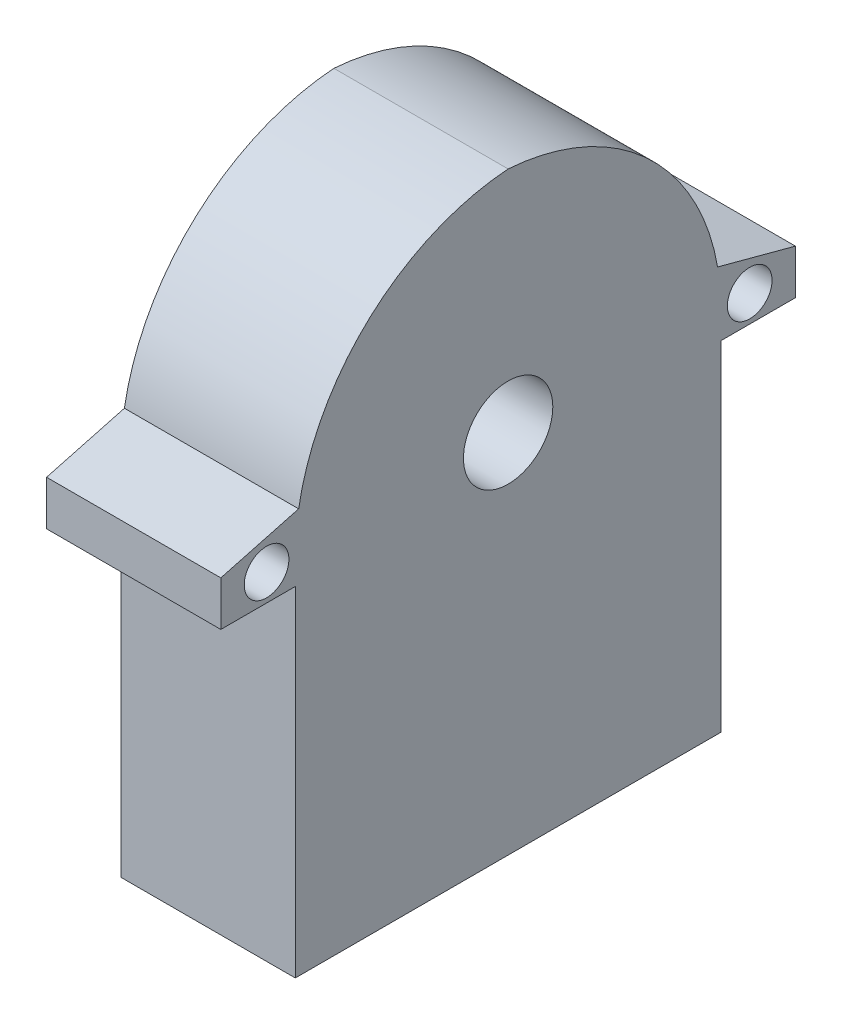
ISO-10303-21;
HEADER;
FILE_DESCRIPTION(('STEP AP214'),'2;1');
FILE_NAME('part.step','',(''),(''),'','','');
FILE_SCHEMA(('AUTOMOTIVE_DESIGN { 1 0 10303 214 1 1 1 1 }'));
ENDSEC;
DATA;
#1=APPLICATION_CONTEXT('core data for automotive mechanical design processes');
#2=APPLICATION_PROTOCOL_DEFINITION('international standard','automotive_design',2000,#1);
#3=PRODUCT_CONTEXT('',#1,'mechanical');
#4=PRODUCT('Part','Part','',(#3));
#5=PRODUCT_RELATED_PRODUCT_CATEGORY('part','',(#4));
#6=PRODUCT_DEFINITION_FORMATION('','',#4);
#7=PRODUCT_DEFINITION_CONTEXT('part definition',#1,'design');
#8=PRODUCT_DEFINITION('design','',#6,#7);
#9=PRODUCT_DEFINITION_SHAPE('','',#8);
#10=(LENGTH_UNIT() NAMED_UNIT(*) SI_UNIT(.MILLI.,.METRE.));
#11=(NAMED_UNIT(*) PLANE_ANGLE_UNIT() SI_UNIT($,.RADIAN.));
#12=(NAMED_UNIT(*) SI_UNIT($,.STERADIAN.) SOLID_ANGLE_UNIT());
#13=UNCERTAINTY_MEASURE_WITH_UNIT(LENGTH_MEASURE(1.E-05),#10,'distance_accuracy_value','');
#14=(GEOMETRIC_REPRESENTATION_CONTEXT(3) GLOBAL_UNCERTAINTY_ASSIGNED_CONTEXT((#13)) GLOBAL_UNIT_ASSIGNED_CONTEXT((#10,
#11,#12)) REPRESENTATION_CONTEXT('',''));
#15=CARTESIAN_POINT('',(0.,0.,0.));
#16=DIRECTION('',(0.,0.,1.));
#17=DIRECTION('',(1.,0.,0.));
#18=AXIS2_PLACEMENT_3D('',#15,#16,#17);
#19=CARTESIAN_POINT('',(11.7,20.896432160804,42.3673366834171));
#20=DIRECTION('',(0.,0.,-1.));
#21=DIRECTION('',(0.,1.,0.));
#22=AXIS2_PLACEMENT_3D('',#19,#20,#21);
#23=PLANE('',#22);
#24=DIRECTION('',(0.,-1.,0.));
#25=VECTOR('',#24,1.);
#26=CARTESIAN_POINT('',(11.7,20.896432160804,42.3673366834171));
#27=LINE('',#26,#25);
#28=CARTESIAN_POINT('',(11.7,3.72344059561265,42.3673366834171));
#29=VERTEX_POINT('',#28);
#30=CARTESIAN_POINT('',(11.7,-19.043567839196,42.3673366834171));
#31=VERTEX_POINT('',#30);
#32=EDGE_CURVE('E230',#29,#31,#27,.T.);
#33=ORIENTED_EDGE('',*,*,#32,.F.);
#34=DIRECTION('',(1.,0.,0.));
#35=VECTOR('',#34,1.);
#36=CARTESIAN_POINT('',(0.,3.72344059561265,42.3673366834171));
#37=LINE('',#36,#35);
#38=CARTESIAN_POINT('',(0.,3.72344059561265,42.3673366834171));
#39=VERTEX_POINT('',#38);
#40=EDGE_CURVE('E179',#39,#29,#37,.T.);
#41=ORIENTED_EDGE('',*,*,#40,.F.);
#42=DIRECTION('',(0.,-1.,0.));
#43=VECTOR('',#42,1.);
#44=CARTESIAN_POINT('',(0.,20.896432160804,42.3673366834171));
#45=LINE('',#44,#43);
#46=CARTESIAN_POINT('',(0.,-19.043567839196,42.3673366834171));
#47=VERTEX_POINT('',#46);
#48=EDGE_CURVE('E178',#39,#47,#45,.T.);
#49=ORIENTED_EDGE('',*,*,#48,.T.);
#50=DIRECTION('',(-1.,0.,0.));
#51=VECTOR('',#50,1.);
#52=CARTESIAN_POINT('',(11.7,-19.043567839196,42.3673366834171));
#53=LINE('',#52,#51);
#54=EDGE_CURVE('E160',#31,#47,#53,.T.);
#55=ORIENTED_EDGE('',*,*,#54,.F.);
#56=EDGE_LOOP('',(#33,#41,#49,#55));
#57=FACE_BOUND('',#56,.T.);
#58=ADVANCED_FACE('F47',(#57),#23,.F.);
#59=CARTESIAN_POINT('',(11.7,-19.043567839196,42.3673366834171));
#60=DIRECTION('',(0.,1.,0.));
#61=DIRECTION('',(0.,0.,1.));
#62=AXIS2_PLACEMENT_3D('',#59,#60,#61);
#63=PLANE('',#62);
#64=DIRECTION('',(0.,0.,-1.));
#65=VECTOR('',#64,1.);
#66=CARTESIAN_POINT('',(0.,-19.043567839196,42.3673366834171));
#67=LINE('',#66,#65);
#68=CARTESIAN_POINT('',(0.,-19.043567839196,13.7873366834171));
#69=VERTEX_POINT('',#68);
#70=EDGE_CURVE('E182',#47,#69,#67,.T.);
#71=ORIENTED_EDGE('',*,*,#70,.T.);
#72=DIRECTION('',(-1.,0.,0.));
#73=VECTOR('',#72,1.);
#74=CARTESIAN_POINT('',(11.7,-19.043567839196,13.7873366834171));
#75=LINE('',#74,#73);
#76=CARTESIAN_POINT('',(11.7,-19.043567839196,13.7873366834171));
#77=VERTEX_POINT('',#76);
#78=EDGE_CURVE('E166',#77,#69,#75,.T.);
#79=ORIENTED_EDGE('',*,*,#78,.F.);
#80=DIRECTION('',(0.,0.,-1.));
#81=VECTOR('',#80,1.);
#82=CARTESIAN_POINT('',(11.7,-19.043567839196,42.3673366834171));
#83=LINE('',#82,#81);
#84=EDGE_CURVE('E233',#31,#77,#83,.T.);
#85=ORIENTED_EDGE('',*,*,#84,.F.);
#86=ORIENTED_EDGE('',*,*,#54,.T.);
#87=EDGE_LOOP('',(#71,#79,#85,#86));
#88=FACE_BOUND('',#87,.T.);
#89=ADVANCED_FACE('F263',(#88),#63,.F.);
#90=CARTESIAN_POINT('',(11.7,-19.043567839196,13.7873366834171));
#91=DIRECTION('',(0.,0.,1.));
#92=DIRECTION('',(1.,0.,0.));
#93=AXIS2_PLACEMENT_3D('',#90,#91,#92);
#94=PLANE('',#93);
#95=DIRECTION('',(0.,1.,0.));
#96=VECTOR('',#95,1.);
#97=CARTESIAN_POINT('',(0.,-19.043567839196,13.7873366834171));
#98=LINE('',#97,#96);
#99=CARTESIAN_POINT('',(0.,3.72344059561265,13.7873366834171));
#100=VERTEX_POINT('',#99);
#101=EDGE_CURVE('E234',#69,#100,#98,.T.);
#102=ORIENTED_EDGE('',*,*,#101,.T.);
#103=DIRECTION('',(1.,0.,0.));
#104=VECTOR('',#103,1.);
#105=CARTESIAN_POINT('',(0.,3.72344059561265,13.7873366834171));
#106=LINE('',#105,#104);
#107=CARTESIAN_POINT('',(11.7,3.72344059561265,13.7873366834171));
#108=VERTEX_POINT('',#107);
#109=EDGE_CURVE('E196',#100,#108,#106,.T.);
#110=ORIENTED_EDGE('',*,*,#109,.T.);
#111=DIRECTION('',(0.,1.,0.));
#112=VECTOR('',#111,1.);
#113=CARTESIAN_POINT('',(11.7,-19.043567839196,13.7873366834171));
#114=LINE('',#113,#112);
#115=EDGE_CURVE('E237',#77,#108,#114,.T.);
#116=ORIENTED_EDGE('',*,*,#115,.F.);
#117=ORIENTED_EDGE('',*,*,#78,.T.);
#118=EDGE_LOOP('',(#102,#110,#116,#117));
#119=FACE_BOUND('',#118,.T.);
#120=ADVANCED_FACE('F251',(#119),#94,.F.);
#121=CARTESIAN_POINT('',(11.7,0.,0.));
#122=DIRECTION('',(1.,0.,0.));
#123=DIRECTION('',(0.,0.,-1.));
#124=AXIS2_PLACEMENT_3D('',#121,#122,#123);
#125=PLANE('',#124);
#126=CARTESIAN_POINT('',(11.7,5.52637682216266,28.0773366834171));
#127=DIRECTION('',(1.,0.,0.));
#128=DIRECTION('',(0.,0.,-1.));
#129=AXIS2_PLACEMENT_3D('',#126,#127,#128);
#130=CIRCLE('',#129,3.);
#131=CARTESIAN_POINT('',(11.7,5.52637682216266,25.0773366834171));
#132=VERTEX_POINT('',#131);
#133=EDGE_CURVE('E421',#132,#132,#130,.T.);
#134=ORIENTED_EDGE('',*,*,#133,.F.);
#135=EDGE_LOOP('',(#134));
#136=FACE_BOUND('',#135,.T.);
#137=CARTESIAN_POINT('',(11.7,5.52637682216266,44.2973366834171));
#138=DIRECTION('',(1.,0.,0.));
#139=DIRECTION('',(0.,0.,-1.));
#140=AXIS2_PLACEMENT_3D('',#137,#138,#139);
#141=CIRCLE('',#140,1.5);
#142=CARTESIAN_POINT('',(11.7,5.52637682216266,42.7973366834171));
#143=VERTEX_POINT('',#142);
#144=EDGE_CURVE('E431',#143,#143,#141,.T.);
#145=ORIENTED_EDGE('',*,*,#144,.F.);
#146=EDGE_LOOP('',(#145));
#147=FACE_BOUND('',#146,.T.);
#148=CARTESIAN_POINT('',(11.7,5.52637682216266,11.8573366834171));
#149=DIRECTION('',(1.,0.,0.));
#150=DIRECTION('',(0.,0.,-1.));
#151=AXIS2_PLACEMENT_3D('',#148,#149,#150);
#152=CIRCLE('',#151,1.5);
#153=CARTESIAN_POINT('',(11.7,5.52637682216266,10.3573366834171));
#154=VERTEX_POINT('',#153);
#155=EDGE_CURVE('E435',#154,#154,#152,.T.);
#156=ORIENTED_EDGE('',*,*,#155,.F.);
#157=EDGE_LOOP('',(#156));
#158=FACE_BOUND('',#157,.T.);
#159=DIRECTION('',(0.,0.,-1.));
#160=VECTOR('',#159,1.);
#161=CARTESIAN_POINT('',(11.7,3.72344059561265,47.3673366834171));
#162=LINE('',#161,#160);
#163=CARTESIAN_POINT('',(11.7,3.72344059561265,47.3673366834171));
#164=VERTEX_POINT('',#163);
#165=EDGE_CURVE('E154',#164,#29,#162,.T.);
#166=ORIENTED_EDGE('',*,*,#165,.T.);
#167=ORIENTED_EDGE('',*,*,#32,.T.);
#168=ORIENTED_EDGE('',*,*,#84,.T.);
#169=ORIENTED_EDGE('',*,*,#115,.T.);
#170=DIRECTION('',(0.,0.,-1.));
#171=VECTOR('',#170,1.);
#172=CARTESIAN_POINT('',(11.7,3.72344059561265,13.7873366834171));
#173=LINE('',#172,#171);
#174=CARTESIAN_POINT('',(11.7,3.72344059561265,8.78733668341708));
#175=VERTEX_POINT('',#174);
#176=EDGE_CURVE('E217',#108,#175,#173,.T.);
#177=ORIENTED_EDGE('',*,*,#176,.T.);
#178=DIRECTION('',(0.,1.,0.));
#179=VECTOR('',#178,1.);
#180=CARTESIAN_POINT('',(11.7,3.72344059561265,8.78733668341708));
#181=LINE('',#180,#179);
#182=CARTESIAN_POINT('',(11.7,6.72344059561265,8.78733668341708));
#183=VERTEX_POINT('',#182);
#184=EDGE_CURVE('E213',#175,#183,#181,.T.);
#185=ORIENTED_EDGE('',*,*,#184,.T.);
#186=DIRECTION('',(0.,0.258819045102518,0.965925826289069));
#187=VECTOR('',#186,1.);
#188=CARTESIAN_POINT('',(11.7,6.72344059561265,8.78733668341708));
#189=LINE('',#188,#187);
#190=CARTESIAN_POINT('',(11.7,8.12367862218153,14.0130961412621));
#191=VERTEX_POINT('',#190);
#192=EDGE_CURVE('E63',#183,#191,#189,.T.);
#193=ORIENTED_EDGE('',*,*,#192,.T.);
#194=CARTESIAN_POINT('',(11.7,5.49643216080401,29.1873366834171));
#195=DIRECTION('',(1.,0.,0.));
#196=DIRECTION('',(0.,0.,-1.));
#197=AXIS2_PLACEMENT_3D('',#194,#195,#196);
#198=CIRCLE('',#197,15.4);
#199=CARTESIAN_POINT('',(11.7,20.8563768221627,28.0773366834171));
#200=VERTEX_POINT('',#199);
#201=EDGE_CURVE('E11',#191,#200,#198,.T.);
#202=ORIENTED_EDGE('',*,*,#201,.T.);
#203=CARTESIAN_POINT('',(11.7,5.49643216080401,26.9673366834171));
#204=DIRECTION('',(1.,0.,0.));
#205=DIRECTION('',(0.,0.,-1.));
#206=AXIS2_PLACEMENT_3D('',#203,#204,#205);
#207=CIRCLE('',#206,15.4);
#208=CARTESIAN_POINT('',(11.7,8.12367862218152,42.141577225572));
#209=VERTEX_POINT('',#208);
#210=EDGE_CURVE('E57',#200,#209,#207,.T.);
#211=ORIENTED_EDGE('',*,*,#210,.T.);
#212=DIRECTION('',(0.,-0.258819045102519,0.965925826289069));
#213=VECTOR('',#212,1.);
#214=CARTESIAN_POINT('',(11.7,8.12367862218152,42.141577225572));
#215=LINE('',#214,#213);
#216=CARTESIAN_POINT('',(11.7,6.72344059561265,47.3673366834171));
#217=VERTEX_POINT('',#216);
#218=EDGE_CURVE('E136',#209,#217,#215,.T.);
#219=ORIENTED_EDGE('',*,*,#218,.T.);
#220=DIRECTION('',(0.,-1.,0.));
#221=VECTOR('',#220,1.);
#222=CARTESIAN_POINT('',(11.7,6.72344059561265,47.3673366834171));
#223=LINE('',#222,#221);
#224=EDGE_CURVE('E271',#217,#164,#223,.T.);
#225=ORIENTED_EDGE('',*,*,#224,.T.);
#226=EDGE_LOOP('',(#166,#167,#168,#169,#177,#185,#193,#202,#211,#219,#225));
#227=FACE_BOUND('',#226,.T.);
#228=ADVANCED_FACE('F172',(#136,#147,#158,#227),#125,.T.);
#229=CARTESIAN_POINT('',(0.,0.,0.));
#230=DIRECTION('',(1.,0.,0.));
#231=DIRECTION('',(0.,0.,-1.));
#232=AXIS2_PLACEMENT_3D('',#229,#230,#231);
#233=PLANE('',#232);
#234=CARTESIAN_POINT('',(0.,5.52637682216266,28.0773366834171));
#235=DIRECTION('',(1.,0.,0.));
#236=DIRECTION('',(0.,0.,-1.));
#237=AXIS2_PLACEMENT_3D('',#234,#235,#236);
#238=CIRCLE('',#237,3.);
#239=CARTESIAN_POINT('',(0.,5.52637682216266,25.0773366834171));
#240=VERTEX_POINT('',#239);
#241=EDGE_CURVE('E418',#240,#240,#238,.T.);
#242=ORIENTED_EDGE('',*,*,#241,.T.);
#243=EDGE_LOOP('',(#242));
#244=FACE_BOUND('',#243,.T.);
#245=CARTESIAN_POINT('',(0.,5.52637682216266,44.2973366834171));
#246=DIRECTION('',(1.,0.,0.));
#247=DIRECTION('',(0.,0.,-1.));
#248=AXIS2_PLACEMENT_3D('',#245,#246,#247);
#249=CIRCLE('',#248,1.5);
#250=CARTESIAN_POINT('',(0.,5.52637682216266,42.7973366834171));
#251=VERTEX_POINT('',#250);
#252=EDGE_CURVE('E210',#251,#251,#249,.T.);
#253=ORIENTED_EDGE('',*,*,#252,.T.);
#254=EDGE_LOOP('',(#253));
#255=FACE_BOUND('',#254,.T.);
#256=CARTESIAN_POINT('',(0.,5.52637682216266,11.8573366834171));
#257=DIRECTION('',(1.,0.,0.));
#258=DIRECTION('',(0.,0.,-1.));
#259=AXIS2_PLACEMENT_3D('',#256,#257,#258);
#260=CIRCLE('',#259,1.5);
#261=CARTESIAN_POINT('',(0.,5.52637682216266,10.3573366834171));
#262=VERTEX_POINT('',#261);
#263=EDGE_CURVE('E425',#262,#262,#260,.T.);
#264=ORIENTED_EDGE('',*,*,#263,.T.);
#265=EDGE_LOOP('',(#264));
#266=FACE_BOUND('',#265,.T.);
#267=ORIENTED_EDGE('',*,*,#48,.F.);
#268=DIRECTION('',(0.,0.,-1.));
#269=VECTOR('',#268,1.);
#270=CARTESIAN_POINT('',(0.,3.72344059561265,47.3673366834171));
#271=LINE('',#270,#269);
#272=CARTESIAN_POINT('',(0.,3.72344059561265,47.3673366834171));
#273=VERTEX_POINT('',#272);
#274=EDGE_CURVE('E141',#273,#39,#271,.T.);
#275=ORIENTED_EDGE('',*,*,#274,.F.);
#276=DIRECTION('',(0.,-1.,0.));
#277=VECTOR('',#276,1.);
#278=CARTESIAN_POINT('',(0.,6.72344059561265,47.3673366834171));
#279=LINE('',#278,#277);
#280=CARTESIAN_POINT('',(0.,6.72344059561265,47.3673366834171));
#281=VERTEX_POINT('',#280);
#282=EDGE_CURVE('E152',#281,#273,#279,.T.);
#283=ORIENTED_EDGE('',*,*,#282,.F.);
#284=DIRECTION('',(0.,-0.258819045102519,0.965925826289069));
#285=VECTOR('',#284,1.);
#286=CARTESIAN_POINT('',(0.,8.12367862218152,42.141577225572));
#287=LINE('',#286,#285);
#288=CARTESIAN_POINT('',(0.,8.12367862218152,42.141577225572));
#289=VERTEX_POINT('',#288);
#290=EDGE_CURVE('E134',#289,#281,#287,.T.);
#291=ORIENTED_EDGE('',*,*,#290,.F.);
#292=CARTESIAN_POINT('',(0.,5.49643216080401,26.9673366834171));
#293=DIRECTION('',(1.,0.,0.));
#294=DIRECTION('',(0.,0.,-1.));
#295=AXIS2_PLACEMENT_3D('',#292,#293,#294);
#296=CIRCLE('',#295,15.4);
#297=CARTESIAN_POINT('',(0.,20.8563768221627,28.0773366834171));
#298=VERTEX_POINT('',#297);
#299=EDGE_CURVE('E148',#289,#298,#296,.F.);
#300=ORIENTED_EDGE('',*,*,#299,.T.);
#301=CARTESIAN_POINT('',(0.,5.49643216080401,29.1873366834171));
#302=DIRECTION('',(1.,0.,0.));
#303=DIRECTION('',(0.,0.,-1.));
#304=AXIS2_PLACEMENT_3D('',#301,#302,#303);
#305=CIRCLE('',#304,15.4);
#306=CARTESIAN_POINT('',(0.,8.12367862218151,14.0130961412621));
#307=VERTEX_POINT('',#306);
#308=EDGE_CURVE('E159',#298,#307,#305,.F.);
#309=ORIENTED_EDGE('',*,*,#308,.T.);
#310=DIRECTION('',(0.,0.258819045102518,0.965925826289069));
#311=VECTOR('',#310,1.);
#312=CARTESIAN_POINT('',(0.,6.72344059561265,8.78733668341708));
#313=LINE('',#312,#311);
#314=CARTESIAN_POINT('',(0.,6.72344059561265,8.78733668341708));
#315=VERTEX_POINT('',#314);
#316=EDGE_CURVE('E200',#315,#307,#313,.T.);
#317=ORIENTED_EDGE('',*,*,#316,.F.);
#318=DIRECTION('',(0.,1.,0.));
#319=VECTOR('',#318,1.);
#320=CARTESIAN_POINT('',(0.,3.72344059561265,8.78733668341708));
#321=LINE('',#320,#319);
#322=CARTESIAN_POINT('',(0.,3.72344059561265,8.78733668341708));
#323=VERTEX_POINT('',#322);
#324=EDGE_CURVE('E223',#323,#315,#321,.T.);
#325=ORIENTED_EDGE('',*,*,#324,.F.);
#326=DIRECTION('',(0.,0.,-1.));
#327=VECTOR('',#326,1.);
#328=CARTESIAN_POINT('',(0.,3.72344059561265,13.7873366834171));
#329=LINE('',#328,#327);
#330=EDGE_CURVE('E214',#100,#323,#329,.T.);
#331=ORIENTED_EDGE('',*,*,#330,.F.);
#332=ORIENTED_EDGE('',*,*,#101,.F.);
#333=ORIENTED_EDGE('',*,*,#70,.F.);
#334=EDGE_LOOP('',(#267,#275,#283,#291,#300,#309,#317,#325,#331,#332,#333));
#335=FACE_BOUND('',#334,.T.);
#336=ADVANCED_FACE('F146',(#244,#255,#266,#335),#233,.F.);
#337=CARTESIAN_POINT('',(11.7,5.49643216080401,26.9673366834171));
#338=DIRECTION('',(-1.,0.,0.));
#339=DIRECTION('',(0.,0.,1.));
#340=AXIS2_PLACEMENT_3D('',#337,#338,#339);
#341=CYLINDRICAL_SURFACE('',#340,15.4);
#342=DIRECTION('',(1.,0.,0.));
#343=VECTOR('',#342,1.);
#344=CARTESIAN_POINT('',(0.,8.12367862218152,42.141577225572));
#345=LINE('',#344,#343);
#346=EDGE_CURVE('E131',#289,#209,#345,.T.);
#347=ORIENTED_EDGE('',*,*,#346,.T.);
#348=ORIENTED_EDGE('',*,*,#210,.F.);
#349=DIRECTION('',(-1.,0.,0.));
#350=VECTOR('',#349,1.);
#351=CARTESIAN_POINT('',(5.85,20.8563768221627,28.0773366834171));
#352=LINE('',#351,#350);
#353=EDGE_CURVE('E51',#298,#200,#352,.F.);
#354=ORIENTED_EDGE('',*,*,#353,.F.);
#355=ORIENTED_EDGE('',*,*,#299,.F.);
#356=EDGE_LOOP('',(#347,#348,#354,#355));
#357=FACE_BOUND('',#356,.T.);
#358=ADVANCED_FACE('F49',(#357),#341,.T.);
#359=CARTESIAN_POINT('',(11.7,5.49643216080401,29.1873366834171));
#360=DIRECTION('',(-1.,0.,0.));
#361=DIRECTION('',(0.,0.,1.));
#362=AXIS2_PLACEMENT_3D('',#359,#360,#361);
#363=CYLINDRICAL_SURFACE('',#362,15.4);
#364=DIRECTION('',(1.,0.,0.));
#365=VECTOR('',#364,1.);
#366=CARTESIAN_POINT('',(0.,8.12367862218151,14.0130961412621));
#367=LINE('',#366,#365);
#368=EDGE_CURVE('E207',#307,#191,#367,.T.);
#369=ORIENTED_EDGE('',*,*,#368,.F.);
#370=ORIENTED_EDGE('',*,*,#308,.F.);
#371=ORIENTED_EDGE('',*,*,#353,.T.);
#372=ORIENTED_EDGE('',*,*,#201,.F.);
#373=EDGE_LOOP('',(#369,#370,#371,#372));
#374=FACE_BOUND('',#373,.T.);
#375=ADVANCED_FACE('F176',(#374),#363,.T.);
#376=CARTESIAN_POINT('',(0.,6.72344059561265,8.78733668341708));
#377=DIRECTION('',(0.,0.965925826289069,-0.258819045102518));
#378=DIRECTION('',(0.,0.258819045102518,0.965925826289069));
#379=AXIS2_PLACEMENT_3D('',#376,#377,#378);
#380=PLANE('',#379);
#381=ORIENTED_EDGE('',*,*,#192,.F.);
#382=DIRECTION('',(1.,0.,0.));
#383=VECTOR('',#382,1.);
#384=CARTESIAN_POINT('',(0.,6.72344059561265,8.78733668341708));
#385=LINE('',#384,#383);
#386=EDGE_CURVE('E204',#315,#183,#385,.T.);
#387=ORIENTED_EDGE('',*,*,#386,.F.);
#388=ORIENTED_EDGE('',*,*,#316,.T.);
#389=ORIENTED_EDGE('',*,*,#368,.T.);
#390=EDGE_LOOP('',(#381,#387,#388,#389));
#391=FACE_BOUND('',#390,.T.);
#392=ADVANCED_FACE('F294',(#391),#380,.T.);
#393=CARTESIAN_POINT('',(0.,3.72344059561265,8.78733668341708));
#394=DIRECTION('',(0.,0.,-1.));
#395=DIRECTION('',(-1.,0.,0.));
#396=AXIS2_PLACEMENT_3D('',#393,#394,#395);
#397=PLANE('',#396);
#398=ORIENTED_EDGE('',*,*,#184,.F.);
#399=DIRECTION('',(1.,0.,0.));
#400=VECTOR('',#399,1.);
#401=CARTESIAN_POINT('',(0.,3.72344059561265,8.78733668341708));
#402=LINE('',#401,#400);
#403=EDGE_CURVE('E201',#323,#175,#402,.T.);
#404=ORIENTED_EDGE('',*,*,#403,.F.);
#405=ORIENTED_EDGE('',*,*,#324,.T.);
#406=ORIENTED_EDGE('',*,*,#386,.T.);
#407=EDGE_LOOP('',(#398,#404,#405,#406));
#408=FACE_BOUND('',#407,.T.);
#409=ADVANCED_FACE('F299',(#408),#397,.T.);
#410=CARTESIAN_POINT('',(0.,3.72344059561265,13.7873366834171));
#411=DIRECTION('',(0.,-1.,0.));
#412=DIRECTION('',(0.,0.,-1.));
#413=AXIS2_PLACEMENT_3D('',#410,#411,#412);
#414=PLANE('',#413);
#415=ORIENTED_EDGE('',*,*,#176,.F.);
#416=ORIENTED_EDGE('',*,*,#109,.F.);
#417=ORIENTED_EDGE('',*,*,#330,.T.);
#418=ORIENTED_EDGE('',*,*,#403,.T.);
#419=EDGE_LOOP('',(#415,#416,#417,#418));
#420=FACE_BOUND('',#419,.T.);
#421=ADVANCED_FACE('F259',(#420),#414,.T.);
#422=CARTESIAN_POINT('',(0.,3.72344059561265,47.3673366834171));
#423=DIRECTION('',(0.,-1.,0.));
#424=DIRECTION('',(0.,0.,-1.));
#425=AXIS2_PLACEMENT_3D('',#422,#423,#424);
#426=PLANE('',#425);
#427=ORIENTED_EDGE('',*,*,#165,.F.);
#428=DIRECTION('',(1.,0.,0.));
#429=VECTOR('',#428,1.);
#430=CARTESIAN_POINT('',(0.,3.72344059561265,47.3673366834171));
#431=LINE('',#430,#429);
#432=EDGE_CURVE('E184',#273,#164,#431,.T.);
#433=ORIENTED_EDGE('',*,*,#432,.F.);
#434=ORIENTED_EDGE('',*,*,#274,.T.);
#435=ORIENTED_EDGE('',*,*,#40,.T.);
#436=EDGE_LOOP('',(#427,#433,#434,#435));
#437=FACE_BOUND('',#436,.T.);
#438=ADVANCED_FACE('F275',(#437),#426,.T.);
#439=CARTESIAN_POINT('',(0.,6.72344059561265,47.3673366834171));
#440=DIRECTION('',(0.,0.,1.));
#441=DIRECTION('',(1.,0.,0.));
#442=AXIS2_PLACEMENT_3D('',#439,#440,#441);
#443=PLANE('',#442);
#444=ORIENTED_EDGE('',*,*,#224,.F.);
#445=DIRECTION('',(1.,0.,0.));
#446=VECTOR('',#445,1.);
#447=CARTESIAN_POINT('',(0.,6.72344059561265,47.3673366834171));
#448=LINE('',#447,#446);
#449=EDGE_CURVE('E140',#281,#217,#448,.T.);
#450=ORIENTED_EDGE('',*,*,#449,.F.);
#451=ORIENTED_EDGE('',*,*,#282,.T.);
#452=ORIENTED_EDGE('',*,*,#432,.T.);
#453=EDGE_LOOP('',(#444,#450,#451,#452));
#454=FACE_BOUND('',#453,.T.);
#455=ADVANCED_FACE('F277',(#454),#443,.T.);
#456=CARTESIAN_POINT('',(0.,8.12367862218152,42.141577225572));
#457=DIRECTION('',(0.,0.965925826289069,0.258819045102519));
#458=DIRECTION('',(0.,-0.258819045102519,0.965925826289069));
#459=AXIS2_PLACEMENT_3D('',#456,#457,#458);
#460=PLANE('',#459);
#461=ORIENTED_EDGE('',*,*,#218,.F.);
#462=ORIENTED_EDGE('',*,*,#346,.F.);
#463=ORIENTED_EDGE('',*,*,#290,.T.);
#464=ORIENTED_EDGE('',*,*,#449,.T.);
#465=EDGE_LOOP('',(#461,#462,#463,#464));
#466=FACE_BOUND('',#465,.T.);
#467=ADVANCED_FACE('F133',(#466),#460,.T.);
#468=CARTESIAN_POINT('',(0.,5.52637682216266,11.8573366834171));
#469=DIRECTION('',(1.,0.,0.));
#470=DIRECTION('',(0.,0.,-1.));
#471=AXIS2_PLACEMENT_3D('',#468,#469,#470);
#472=CYLINDRICAL_SURFACE('',#471,1.5);
#473=ORIENTED_EDGE('',*,*,#263,.F.);
#474=EDGE_LOOP('',(#473));
#475=FACE_BOUND('',#474,.T.);
#476=ORIENTED_EDGE('',*,*,#155,.T.);
#477=EDGE_LOOP('',(#476));
#478=FACE_BOUND('',#477,.T.);
#479=ADVANCED_FACE('F284',(#475,#478),#472,.F.);
#480=CARTESIAN_POINT('',(0.,5.52637682216266,44.2973366834171));
#481=DIRECTION('',(1.,0.,0.));
#482=DIRECTION('',(0.,0.,-1.));
#483=AXIS2_PLACEMENT_3D('',#480,#481,#482);
#484=CYLINDRICAL_SURFACE('',#483,1.5);
#485=ORIENTED_EDGE('',*,*,#252,.F.);
#486=EDGE_LOOP('',(#485));
#487=FACE_BOUND('',#486,.T.);
#488=ORIENTED_EDGE('',*,*,#144,.T.);
#489=EDGE_LOOP('',(#488));
#490=FACE_BOUND('',#489,.T.);
#491=ADVANCED_FACE('F395',(#487,#490),#484,.F.);
#492=CARTESIAN_POINT('',(0.,5.52637682216266,28.0773366834171));
#493=DIRECTION('',(1.,0.,0.));
#494=DIRECTION('',(0.,0.,-1.));
#495=AXIS2_PLACEMENT_3D('',#492,#493,#494);
#496=CYLINDRICAL_SURFACE('',#495,3.);
#497=ORIENTED_EDGE('',*,*,#241,.F.);
#498=EDGE_LOOP('',(#497));
#499=FACE_BOUND('',#498,.T.);
#500=ORIENTED_EDGE('',*,*,#133,.T.);
#501=EDGE_LOOP('',(#500));
#502=FACE_BOUND('',#501,.T.);
#503=ADVANCED_FACE('F404',(#499,#502),#496,.F.);
#504=CLOSED_SHELL('',(#58,#89,#120,#228,#336,#358,#375,#392,#409,#421,#438,#455,#467,#479,#491,#503));
#505=MANIFOLD_SOLID_BREP('B2',#504);
#506=ADVANCED_BREP_SHAPE_REPRESENTATION('',(#18,#505),#14);
#507=SHAPE_DEFINITION_REPRESENTATION(#9,#506);
ENDSEC;
END-ISO-10303-21;
